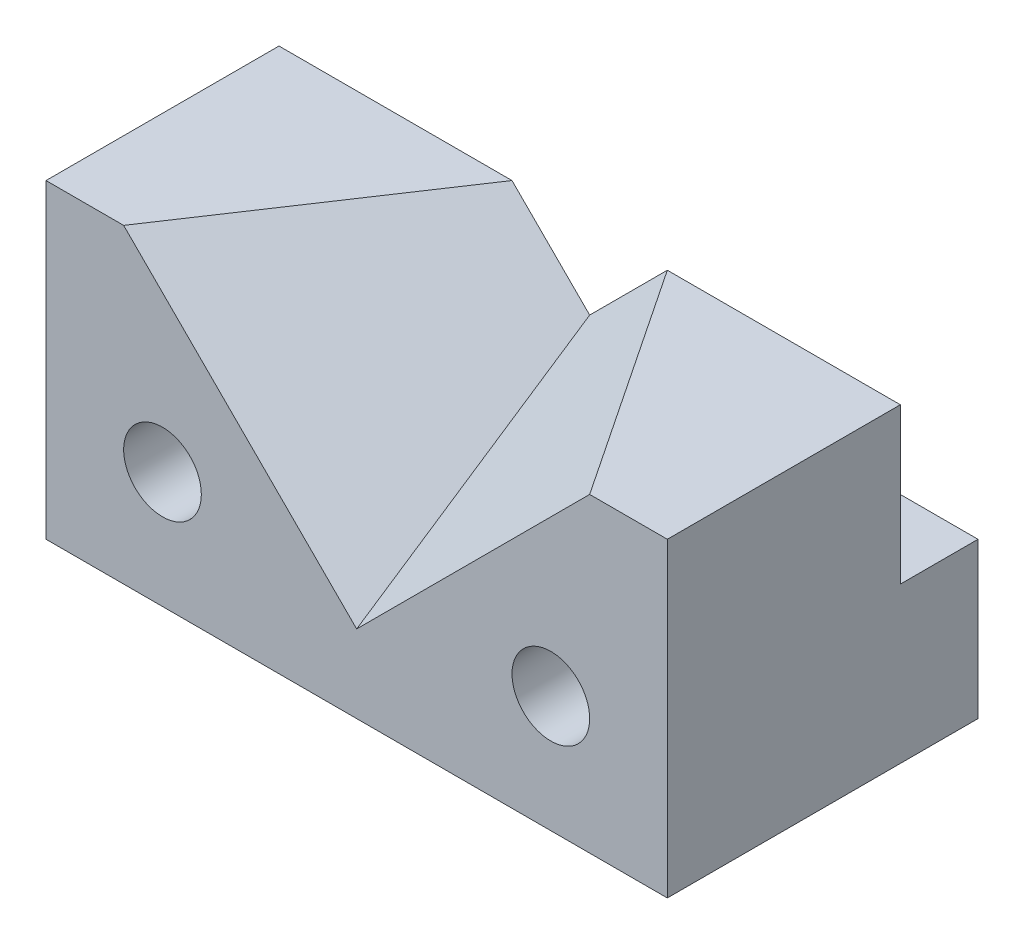
ISO-10303-21;
HEADER;
FILE_DESCRIPTION(('STEP AP214'),'2;1');
FILE_NAME('part.step','',(''),(''),'','','');
FILE_SCHEMA(('AUTOMOTIVE_DESIGN { 1 0 10303 214 1 1 1 1 }'));
ENDSEC;
DATA;
#1=APPLICATION_CONTEXT('core data for automotive mechanical design processes');
#2=APPLICATION_PROTOCOL_DEFINITION('international standard','automotive_design',2000,#1);
#3=PRODUCT_CONTEXT('',#1,'mechanical');
#4=PRODUCT('Part','Part','',(#3));
#5=PRODUCT_RELATED_PRODUCT_CATEGORY('part','',(#4));
#6=PRODUCT_DEFINITION_FORMATION('','',#4);
#7=PRODUCT_DEFINITION_CONTEXT('part definition',#1,'design');
#8=PRODUCT_DEFINITION('design','',#6,#7);
#9=PRODUCT_DEFINITION_SHAPE('','',#8);
#10=(LENGTH_UNIT() NAMED_UNIT(*) SI_UNIT(.MILLI.,.METRE.));
#11=(NAMED_UNIT(*) PLANE_ANGLE_UNIT() SI_UNIT($,.RADIAN.));
#12=(NAMED_UNIT(*) SI_UNIT($,.STERADIAN.) SOLID_ANGLE_UNIT());
#13=UNCERTAINTY_MEASURE_WITH_UNIT(LENGTH_MEASURE(1.E-05),#10,'distance_accuracy_value','');
#14=(GEOMETRIC_REPRESENTATION_CONTEXT(3) GLOBAL_UNCERTAINTY_ASSIGNED_CONTEXT((#13)) GLOBAL_UNIT_ASSIGNED_CONTEXT((#10,
#11,#12)) REPRESENTATION_CONTEXT('',''));
#15=CARTESIAN_POINT('',(0.,0.,0.));
#16=DIRECTION('',(0.,0.,1.));
#17=DIRECTION('',(1.,0.,0.));
#18=AXIS2_PLACEMENT_3D('',#15,#16,#17);
#19=CARTESIAN_POINT('',(0.,20.,20.));
#20=DIRECTION('',(0.,-1.,0.));
#21=DIRECTION('',(0.,0.,-1.));
#22=AXIS2_PLACEMENT_3D('',#19,#20,#21);
#23=PLANE('',#22);
#24=DIRECTION('',(-0.554700196225229,0.,0.832050294337844));
#25=VECTOR('',#24,1.);
#26=CARTESIAN_POINT('',(15.,20.,5.));
#27=LINE('',#26,#25);
#28=CARTESIAN_POINT('',(15.,20.,5.));
#29=VERTEX_POINT('',#28);
#30=CARTESIAN_POINT('',(5.,20.,20.));
#31=VERTEX_POINT('',#30);
#32=EDGE_CURVE('E369',#29,#31,#27,.T.);
#33=ORIENTED_EDGE('',*,*,#32,.F.);
#34=DIRECTION('',(1.,0.,0.));
#35=VECTOR('',#34,1.);
#36=CARTESIAN_POINT('',(40.,20.,5.));
#37=LINE('',#36,#35);
#38=CARTESIAN_POINT('',(0.,20.,5.00000000000001));
#39=VERTEX_POINT('',#38);
#40=EDGE_CURVE('E205',#39,#29,#37,.T.);
#41=ORIENTED_EDGE('',*,*,#40,.F.);
#42=DIRECTION('',(0.,0.,-1.));
#43=VECTOR('',#42,1.);
#44=CARTESIAN_POINT('',(0.,20.,20.));
#45=LINE('',#44,#43);
#46=CARTESIAN_POINT('',(0.,20.,20.));
#47=VERTEX_POINT('',#46);
#48=EDGE_CURVE('E191',#47,#39,#45,.T.);
#49=ORIENTED_EDGE('',*,*,#48,.F.);
#50=DIRECTION('',(-1.,0.,0.));
#51=VECTOR('',#50,1.);
#52=CARTESIAN_POINT('',(0.,20.,20.));
#53=LINE('',#52,#51);
#54=EDGE_CURVE('E73',#31,#47,#53,.T.);
#55=ORIENTED_EDGE('',*,*,#54,.F.);
#56=EDGE_LOOP('',(#33,#41,#49,#55));
#57=FACE_BOUND('',#56,.T.);
#58=ADVANCED_FACE('F44',(#57),#23,.F.);
#59=DIRECTION('',(0.554700196225229,0.,0.832050294337844));
#60=VECTOR('',#59,1.);
#61=CARTESIAN_POINT('',(25.,20.,5.));
#62=LINE('',#61,#60);
#63=CARTESIAN_POINT('',(25.,20.,5.));
#64=VERTEX_POINT('',#63);
#65=CARTESIAN_POINT('',(35.,20.,20.));
#66=VERTEX_POINT('',#65);
#67=EDGE_CURVE('E64',#64,#66,#62,.T.);
#68=ORIENTED_EDGE('',*,*,#67,.T.);
#69=CARTESIAN_POINT('',(40.,20.,20.));
#70=VERTEX_POINT('',#69);
#71=EDGE_CURVE('E196',#70,#66,#53,.T.);
#72=ORIENTED_EDGE('',*,*,#71,.F.);
#73=DIRECTION('',(0.,0.,-1.));
#74=VECTOR('',#73,1.);
#75=CARTESIAN_POINT('',(40.,20.,20.));
#76=LINE('',#75,#74);
#77=CARTESIAN_POINT('',(40.,20.,5.));
#78=VERTEX_POINT('',#77);
#79=EDGE_CURVE('E195',#70,#78,#76,.T.);
#80=ORIENTED_EDGE('',*,*,#79,.T.);
#81=EDGE_CURVE('E211',#64,#78,#37,.T.);
#82=ORIENTED_EDGE('',*,*,#81,.F.);
#83=EDGE_LOOP('',(#68,#72,#80,#82));
#84=FACE_BOUND('',#83,.T.);
#85=ADVANCED_FACE('F340',(#84),#23,.F.);
#86=CARTESIAN_POINT('',(0.,0.,20.));
#87=DIRECTION('',(0.,0.,-1.));
#88=DIRECTION('',(-1.,0.,0.));
#89=AXIS2_PLACEMENT_3D('',#86,#87,#88);
#90=PLANE('',#89);
#91=CARTESIAN_POINT('',(7.5,7.5,20.));
#92=DIRECTION('',(0.,0.,1.));
#93=DIRECTION('',(1.,0.,0.));
#94=AXIS2_PLACEMENT_3D('',#91,#92,#93);
#95=CIRCLE('',#94,2.5);
#96=CARTESIAN_POINT('',(10.,7.5,20.));
#97=VERTEX_POINT('',#96);
#98=EDGE_CURVE('E228',#97,#97,#95,.T.);
#99=ORIENTED_EDGE('',*,*,#98,.F.);
#100=EDGE_LOOP('',(#99));
#101=FACE_BOUND('',#100,.T.);
#102=CARTESIAN_POINT('',(32.5,7.5,20.));
#103=DIRECTION('',(0.,0.,1.));
#104=DIRECTION('',(-1.,0.,0.));
#105=AXIS2_PLACEMENT_3D('',#102,#103,#104);
#106=CIRCLE('',#105,2.5);
#107=CARTESIAN_POINT('',(30.,7.5,20.));
#108=VERTEX_POINT('',#107);
#109=EDGE_CURVE('E222',#108,#108,#106,.T.);
#110=ORIENTED_EDGE('',*,*,#109,.F.);
#111=EDGE_LOOP('',(#110));
#112=FACE_BOUND('',#111,.T.);
#113=DIRECTION('',(0.707106781186548,-0.707106781186547,0.));
#114=VECTOR('',#113,1.);
#115=CARTESIAN_POINT('',(5.,20.,20.));
#116=LINE('',#115,#114);
#117=CARTESIAN_POINT('',(20.,5.,20.));
#118=VERTEX_POINT('',#117);
#119=EDGE_CURVE('E358',#31,#118,#116,.T.);
#120=ORIENTED_EDGE('',*,*,#119,.F.);
#121=ORIENTED_EDGE('',*,*,#54,.T.);
#122=DIRECTION('',(0.,-1.,0.));
#123=VECTOR('',#122,1.);
#124=CARTESIAN_POINT('',(0.,0.,20.));
#125=LINE('',#124,#123);
#126=CARTESIAN_POINT('',(0.,0.,20.));
#127=VERTEX_POINT('',#126);
#128=EDGE_CURVE('E181',#47,#127,#125,.T.);
#129=ORIENTED_EDGE('',*,*,#128,.T.);
#130=DIRECTION('',(1.,0.,0.));
#131=VECTOR('',#130,1.);
#132=CARTESIAN_POINT('',(0.,0.,20.));
#133=LINE('',#132,#131);
#134=CARTESIAN_POINT('',(40.,0.,20.));
#135=VERTEX_POINT('',#134);
#136=EDGE_CURVE('E95',#127,#135,#133,.T.);
#137=ORIENTED_EDGE('',*,*,#136,.T.);
#138=DIRECTION('',(0.,1.,0.));
#139=VECTOR('',#138,1.);
#140=CARTESIAN_POINT('',(40.,0.,20.));
#141=LINE('',#140,#139);
#142=EDGE_CURVE('E235',#135,#70,#141,.T.);
#143=ORIENTED_EDGE('',*,*,#142,.T.);
#144=ORIENTED_EDGE('',*,*,#71,.T.);
#145=DIRECTION('',(0.707106781186547,0.707106781186548,0.));
#146=VECTOR('',#145,1.);
#147=CARTESIAN_POINT('',(35.,20.,20.));
#148=LINE('',#147,#146);
#149=EDGE_CURVE('E359',#118,#66,#148,.T.);
#150=ORIENTED_EDGE('',*,*,#149,.F.);
#151=EDGE_LOOP('',(#120,#121,#129,#137,#143,#144,#150));
#152=FACE_BOUND('',#151,.T.);
#153=ADVANCED_FACE('F261',(#101,#112,#152),#90,.F.);
#154=CARTESIAN_POINT('',(40.,11.,5.));
#155=DIRECTION('',(0.,0.,1.));
#156=DIRECTION('',(1.,0.,0.));
#157=AXIS2_PLACEMENT_3D('',#154,#155,#156);
#158=PLANE('',#157);
#159=DIRECTION('',(-0.707106781186548,0.707106781186547,0.));
#160=VECTOR('',#159,1.);
#161=CARTESIAN_POINT('',(15.,20.,5.));
#162=LINE('',#161,#160);
#163=CARTESIAN_POINT('',(20.,15.,5.));
#164=VERTEX_POINT('',#163);
#165=EDGE_CURVE('E313',#164,#29,#162,.T.);
#166=ORIENTED_EDGE('',*,*,#165,.F.);
#167=DIRECTION('',(-0.707106781186548,-0.707106781186547,0.));
#168=VECTOR('',#167,1.);
#169=CARTESIAN_POINT('',(25.,20.,5.));
#170=LINE('',#169,#168);
#171=EDGE_CURVE('E377',#64,#164,#170,.T.);
#172=ORIENTED_EDGE('',*,*,#171,.F.);
#173=ORIENTED_EDGE('',*,*,#81,.T.);
#174=DIRECTION('',(0.,1.,0.));
#175=VECTOR('',#174,1.);
#176=CARTESIAN_POINT('',(40.,11.,5.));
#177=LINE('',#176,#175);
#178=CARTESIAN_POINT('',(40.,9.999,5.00000000000001));
#179=VERTEX_POINT('',#178);
#180=EDGE_CURVE('E218',#179,#78,#177,.T.);
#181=ORIENTED_EDGE('',*,*,#180,.F.);
#182=DIRECTION('',(1.,0.,0.));
#183=VECTOR('',#182,1.);
#184=CARTESIAN_POINT('',(40.,9.999,5.00000000000001));
#185=LINE('',#184,#183);
#186=CARTESIAN_POINT('',(32.5707036066973,9.999,5.00000000000001));
#187=VERTEX_POINT('',#186);
#188=EDGE_CURVE('E158',#187,#179,#185,.T.);
#189=ORIENTED_EDGE('',*,*,#188,.F.);
#190=CARTESIAN_POINT('',(32.5,7.5,5.00000000000001));
#191=DIRECTION('',(0.,0.,-1.));
#192=DIRECTION('',(-0.0282814426789152,0.9996,0.));
#193=AXIS2_PLACEMENT_3D('',#190,#191,#192);
#194=CIRCLE('',#193,2.5);
#195=CARTESIAN_POINT('',(32.4292963933027,9.999,5.00000000000001));
#196=VERTEX_POINT('',#195);
#197=EDGE_CURVE('E298',#196,#187,#194,.T.);
#198=ORIENTED_EDGE('',*,*,#197,.F.);
#199=CARTESIAN_POINT('',(7.57070360669722,9.999,5.00000000000001));
#200=VERTEX_POINT('',#199);
#201=EDGE_CURVE('E291',#200,#196,#185,.T.);
#202=ORIENTED_EDGE('',*,*,#201,.F.);
#203=CARTESIAN_POINT('',(7.5,7.5,5.00000000000001));
#204=DIRECTION('',(0.,0.,-1.));
#205=DIRECTION('',(-0.0282814426788912,0.9996,0.));
#206=AXIS2_PLACEMENT_3D('',#203,#204,#205);
#207=CIRCLE('',#206,2.5);
#208=CARTESIAN_POINT('',(7.42929639330277,9.999,5.00000000000001));
#209=VERTEX_POINT('',#208);
#210=EDGE_CURVE('E287',#209,#200,#207,.T.);
#211=ORIENTED_EDGE('',*,*,#210,.F.);
#212=CARTESIAN_POINT('',(0.,9.999,5.00000000000001));
#213=VERTEX_POINT('',#212);
#214=EDGE_CURVE('E289',#213,#209,#185,.T.);
#215=ORIENTED_EDGE('',*,*,#214,.F.);
#216=DIRECTION('',(0.,1.,0.));
#217=VECTOR('',#216,1.);
#218=CARTESIAN_POINT('',(0.,11.,5.00000000000001));
#219=LINE('',#218,#217);
#220=EDGE_CURVE('E210',#213,#39,#219,.T.);
#221=ORIENTED_EDGE('',*,*,#220,.T.);
#222=ORIENTED_EDGE('',*,*,#40,.T.);
#223=EDGE_LOOP('',(#166,#172,#173,#181,#189,#198,#202,#211,#215,#221,#222));
#224=FACE_BOUND('',#223,.T.);
#225=ADVANCED_FACE('F251',(#224),#158,.F.);
#226=CARTESIAN_POINT('',(0.,0.,20.));
#227=DIRECTION('',(1.,0.,0.));
#228=DIRECTION('',(0.,0.,-1.));
#229=AXIS2_PLACEMENT_3D('',#226,#227,#228);
#230=PLANE('',#229);
#231=ORIENTED_EDGE('',*,*,#220,.F.);
#232=DIRECTION('',(0.,0.,1.));
#233=VECTOR('',#232,1.);
#234=CARTESIAN_POINT('',(0.,9.999,0.));
#235=LINE('',#234,#233);
#236=CARTESIAN_POINT('',(0.,9.999,0.));
#237=VERTEX_POINT('',#236);
#238=EDGE_CURVE('E174',#237,#213,#235,.T.);
#239=ORIENTED_EDGE('',*,*,#238,.F.);
#240=DIRECTION('',(0.,-1.,0.));
#241=VECTOR('',#240,1.);
#242=CARTESIAN_POINT('',(0.,0.,0.));
#243=LINE('',#242,#241);
#244=CARTESIAN_POINT('',(0.,0.,0.));
#245=VERTEX_POINT('',#244);
#246=EDGE_CURVE('E187',#237,#245,#243,.T.);
#247=ORIENTED_EDGE('',*,*,#246,.T.);
#248=DIRECTION('',(0.,0.,-1.));
#249=VECTOR('',#248,1.);
#250=CARTESIAN_POINT('',(0.,0.,20.));
#251=LINE('',#250,#249);
#252=EDGE_CURVE('E202',#127,#245,#251,.T.);
#253=ORIENTED_EDGE('',*,*,#252,.F.);
#254=ORIENTED_EDGE('',*,*,#128,.F.);
#255=ORIENTED_EDGE('',*,*,#48,.T.);
#256=EDGE_LOOP('',(#231,#239,#247,#253,#254,#255));
#257=FACE_BOUND('',#256,.T.);
#258=ADVANCED_FACE('F46',(#257),#230,.F.);
#259=CARTESIAN_POINT('',(0.,0.,20.));
#260=DIRECTION('',(0.,1.,0.));
#261=DIRECTION('',(0.,0.,1.));
#262=AXIS2_PLACEMENT_3D('',#259,#260,#261);
#263=PLANE('',#262);
#264=DIRECTION('',(1.,0.,0.));
#265=VECTOR('',#264,1.);
#266=CARTESIAN_POINT('',(0.,0.,0.));
#267=LINE('',#266,#265);
#268=CARTESIAN_POINT('',(40.,0.,0.));
#269=VERTEX_POINT('',#268);
#270=EDGE_CURVE('E90',#245,#269,#267,.T.);
#271=ORIENTED_EDGE('',*,*,#270,.T.);
#272=DIRECTION('',(0.,0.,-1.));
#273=VECTOR('',#272,1.);
#274=CARTESIAN_POINT('',(40.,0.,20.));
#275=LINE('',#274,#273);
#276=EDGE_CURVE('E179',#135,#269,#275,.T.);
#277=ORIENTED_EDGE('',*,*,#276,.F.);
#278=ORIENTED_EDGE('',*,*,#136,.F.);
#279=ORIENTED_EDGE('',*,*,#252,.T.);
#280=EDGE_LOOP('',(#271,#277,#278,#279));
#281=FACE_BOUND('',#280,.T.);
#282=ADVANCED_FACE('F472',(#281),#263,.F.);
#283=CARTESIAN_POINT('',(40.,0.,20.));
#284=DIRECTION('',(-1.,0.,0.));
#285=DIRECTION('',(0.,0.,1.));
#286=AXIS2_PLACEMENT_3D('',#283,#284,#285);
#287=PLANE('',#286);
#288=DIRECTION('',(0.,0.,-1.));
#289=VECTOR('',#288,1.);
#290=CARTESIAN_POINT('',(40.,9.999,0.));
#291=LINE('',#290,#289);
#292=CARTESIAN_POINT('',(40.,9.999,0.));
#293=VERTEX_POINT('',#292);
#294=EDGE_CURVE('E153',#179,#293,#291,.T.);
#295=ORIENTED_EDGE('',*,*,#294,.F.);
#296=ORIENTED_EDGE('',*,*,#180,.T.);
#297=ORIENTED_EDGE('',*,*,#79,.F.);
#298=ORIENTED_EDGE('',*,*,#142,.F.);
#299=ORIENTED_EDGE('',*,*,#276,.T.);
#300=DIRECTION('',(0.,1.,0.));
#301=VECTOR('',#300,1.);
#302=CARTESIAN_POINT('',(40.,0.,0.));
#303=LINE('',#302,#301);
#304=EDGE_CURVE('E169',#269,#293,#303,.T.);
#305=ORIENTED_EDGE('',*,*,#304,.T.);
#306=EDGE_LOOP('',(#295,#296,#297,#298,#299,#305));
#307=FACE_BOUND('',#306,.T.);
#308=ADVANCED_FACE('F177',(#307),#287,.F.);
#309=CARTESIAN_POINT('',(0.,0.,0.));
#310=DIRECTION('',(0.,0.,-1.));
#311=DIRECTION('',(-1.,0.,0.));
#312=AXIS2_PLACEMENT_3D('',#309,#310,#311);
#313=PLANE('',#312);
#314=DIRECTION('',(-1.,0.,0.));
#315=VECTOR('',#314,1.);
#316=CARTESIAN_POINT('',(40.,9.999,0.));
#317=LINE('',#316,#315);
#318=CARTESIAN_POINT('',(32.5707036066973,9.999,0.));
#319=VERTEX_POINT('',#318);
#320=EDGE_CURVE('E156',#293,#319,#317,.T.);
#321=ORIENTED_EDGE('',*,*,#320,.F.);
#322=ORIENTED_EDGE('',*,*,#304,.F.);
#323=ORIENTED_EDGE('',*,*,#270,.F.);
#324=ORIENTED_EDGE('',*,*,#246,.F.);
#325=CARTESIAN_POINT('',(7.42929639330277,9.999,0.));
#326=VERTEX_POINT('',#325);
#327=EDGE_CURVE('E163',#326,#237,#317,.T.);
#328=ORIENTED_EDGE('',*,*,#327,.F.);
#329=CARTESIAN_POINT('',(7.5,7.5,0.));
#330=DIRECTION('',(0.,0.,1.));
#331=DIRECTION('',(1.,0.,0.));
#332=AXIS2_PLACEMENT_3D('',#329,#330,#331);
#333=CIRCLE('',#332,2.5);
#334=CARTESIAN_POINT('',(7.57070360669722,9.999,0.));
#335=VERTEX_POINT('',#334);
#336=EDGE_CURVE('E231',#326,#335,#333,.T.);
#337=ORIENTED_EDGE('',*,*,#336,.T.);
#338=CARTESIAN_POINT('',(32.4292963933027,9.999,0.));
#339=VERTEX_POINT('',#338);
#340=EDGE_CURVE('E175',#339,#335,#317,.T.);
#341=ORIENTED_EDGE('',*,*,#340,.F.);
#342=CARTESIAN_POINT('',(32.5,7.5,0.));
#343=DIRECTION('',(0.,0.,1.));
#344=DIRECTION('',(-1.,0.,0.));
#345=AXIS2_PLACEMENT_3D('',#342,#343,#344);
#346=CIRCLE('',#345,2.5);
#347=EDGE_CURVE('E172',#339,#319,#346,.T.);
#348=ORIENTED_EDGE('',*,*,#347,.T.);
#349=EDGE_LOOP('',(#321,#322,#323,#324,#328,#337,#341,#348));
#350=FACE_BOUND('',#349,.T.);
#351=ADVANCED_FACE('F168',(#350),#313,.T.);
#352=CARTESIAN_POINT('',(7.5,7.5,0.));
#353=DIRECTION('',(0.,0.,1.));
#354=DIRECTION('',(1.,0.,0.));
#355=AXIS2_PLACEMENT_3D('',#352,#353,#354);
#356=CYLINDRICAL_SURFACE('',#355,2.5);
#357=ORIENTED_EDGE('',*,*,#210,.T.);
#358=DIRECTION('',(0.,0.,1.));
#359=VECTOR('',#358,1.);
#360=CARTESIAN_POINT('',(7.57070360669723,9.999,0.));
#361=LINE('',#360,#359);
#362=EDGE_CURVE('E310',#200,#335,#361,.F.);
#363=ORIENTED_EDGE('',*,*,#362,.T.);
#364=ORIENTED_EDGE('',*,*,#336,.F.);
#365=DIRECTION('',(0.,0.,1.));
#366=VECTOR('',#365,1.);
#367=CARTESIAN_POINT('',(7.42929639330277,9.999,0.));
#368=LINE('',#367,#366);
#369=EDGE_CURVE('E297',#326,#209,#368,.T.);
#370=ORIENTED_EDGE('',*,*,#369,.T.);
#371=EDGE_LOOP('',(#357,#363,#364,#370));
#372=FACE_BOUND('',#371,.T.);
#373=ORIENTED_EDGE('',*,*,#98,.T.);
#374=EDGE_LOOP('',(#373));
#375=FACE_BOUND('',#374,.T.);
#376=ADVANCED_FACE('F306',(#372,#375),#356,.F.);
#377=CARTESIAN_POINT('',(32.5,7.5,0.));
#378=DIRECTION('',(0.,0.,1.));
#379=DIRECTION('',(1.,0.,0.));
#380=AXIS2_PLACEMENT_3D('',#377,#378,#379);
#381=CYLINDRICAL_SURFACE('',#380,2.5);
#382=ORIENTED_EDGE('',*,*,#197,.T.);
#383=DIRECTION('',(0.,0.,1.));
#384=VECTOR('',#383,1.);
#385=CARTESIAN_POINT('',(32.5707036066973,9.999,0.));
#386=LINE('',#385,#384);
#387=EDGE_CURVE('E12',#187,#319,#386,.F.);
#388=ORIENTED_EDGE('',*,*,#387,.T.);
#389=ORIENTED_EDGE('',*,*,#347,.F.);
#390=DIRECTION('',(0.,0.,1.));
#391=VECTOR('',#390,1.);
#392=CARTESIAN_POINT('',(32.4292963933027,9.999,0.));
#393=LINE('',#392,#391);
#394=EDGE_CURVE('E56',#339,#196,#393,.T.);
#395=ORIENTED_EDGE('',*,*,#394,.T.);
#396=EDGE_LOOP('',(#382,#388,#389,#395));
#397=FACE_BOUND('',#396,.T.);
#398=ORIENTED_EDGE('',*,*,#109,.T.);
#399=EDGE_LOOP('',(#398));
#400=FACE_BOUND('',#399,.T.);
#401=ADVANCED_FACE('F266',(#397,#400),#381,.F.);
#402=CARTESIAN_POINT('',(15.6818181818182,15.6818181818182,10.4545454545454));
#403=DIRECTION('',(0.639602149066831,0.639602149066831,0.426401432711221));
#404=DIRECTION('',(-0.707106781186548,0.707106781186547,0.));
#405=AXIS2_PLACEMENT_3D('',#402,#403,#404);
#406=PLANE('',#405);
#407=DIRECTION('',(0.,-0.554700196225229,0.832050294337844));
#408=VECTOR('',#407,1.);
#409=CARTESIAN_POINT('',(20.,15.,5.));
#410=LINE('',#409,#408);
#411=EDGE_CURVE('E375',#164,#118,#410,.T.);
#412=ORIENTED_EDGE('',*,*,#411,.F.);
#413=ORIENTED_EDGE('',*,*,#165,.T.);
#414=ORIENTED_EDGE('',*,*,#32,.T.);
#415=ORIENTED_EDGE('',*,*,#119,.T.);
#416=EDGE_LOOP('',(#412,#413,#414,#415));
#417=FACE_BOUND('',#416,.T.);
#418=ADVANCED_FACE('F426',(#417),#406,.T.);
#419=CARTESIAN_POINT('',(0.681818181818183,-0.681818181818183,-0.454545454545455));
#420=DIRECTION('',(-0.639602149066831,0.639602149066831,0.426401432711221));
#421=DIRECTION('',(-0.707106781186547,-0.707106781186548,0.));
#422=AXIS2_PLACEMENT_3D('',#419,#420,#421);
#423=PLANE('',#422);
#424=ORIENTED_EDGE('',*,*,#67,.F.);
#425=ORIENTED_EDGE('',*,*,#171,.T.);
#426=ORIENTED_EDGE('',*,*,#411,.T.);
#427=ORIENTED_EDGE('',*,*,#149,.T.);
#428=EDGE_LOOP('',(#424,#425,#426,#427));
#429=FACE_BOUND('',#428,.T.);
#430=ADVANCED_FACE('F263',(#429),#423,.T.);
#431=CARTESIAN_POINT('',(0.,9.999,0.));
#432=DIRECTION('',(0.,-1.,0.));
#433=DIRECTION('',(0.,0.,-1.));
#434=AXIS2_PLACEMENT_3D('',#431,#432,#433);
#435=PLANE('',#434);
#436=ORIENTED_EDGE('',*,*,#201,.T.);
#437=ORIENTED_EDGE('',*,*,#394,.F.);
#438=ORIENTED_EDGE('',*,*,#340,.T.);
#439=ORIENTED_EDGE('',*,*,#362,.F.);
#440=EDGE_LOOP('',(#436,#437,#438,#439));
#441=FACE_BOUND('',#440,.T.);
#442=ADVANCED_FACE('F435',(#441),#435,.F.);
#443=ORIENTED_EDGE('',*,*,#327,.T.);
#444=ORIENTED_EDGE('',*,*,#238,.T.);
#445=ORIENTED_EDGE('',*,*,#214,.T.);
#446=ORIENTED_EDGE('',*,*,#369,.F.);
#447=EDGE_LOOP('',(#443,#444,#445,#446));
#448=FACE_BOUND('',#447,.T.);
#449=ADVANCED_FACE('F301',(#448),#435,.F.);
#450=ORIENTED_EDGE('',*,*,#188,.T.);
#451=ORIENTED_EDGE('',*,*,#294,.T.);
#452=ORIENTED_EDGE('',*,*,#320,.T.);
#453=ORIENTED_EDGE('',*,*,#387,.F.);
#454=EDGE_LOOP('',(#450,#451,#452,#453));
#455=FACE_BOUND('',#454,.T.);
#456=ADVANCED_FACE('F155',(#455),#435,.F.);
#457=CLOSED_SHELL('',(#58,#85,#153,#225,#258,#282,#308,#351,#376,#401,#418,#430,#442,#449,#456));
#458=MANIFOLD_SOLID_BREP('B2',#457);
#459=ADVANCED_BREP_SHAPE_REPRESENTATION('',(#18,#458),#14);
#460=SHAPE_DEFINITION_REPRESENTATION(#9,#459);
ENDSEC;
END-ISO-10303-21;
